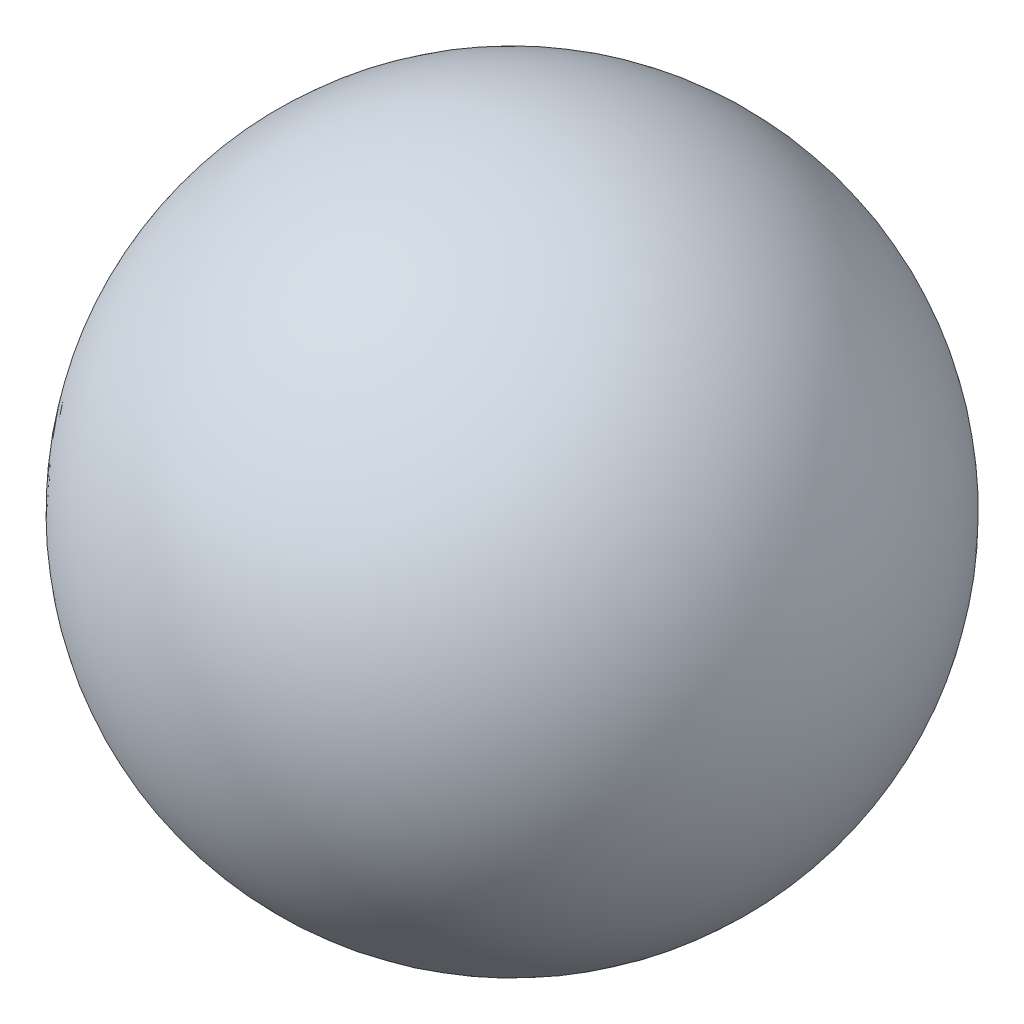
ISO-10303-21;
HEADER;
FILE_DESCRIPTION(('STEP AP214'),'2;1');
FILE_NAME('part.step','',(''),(''),'','','');
FILE_SCHEMA(('AUTOMOTIVE_DESIGN { 1 0 10303 214 1 1 1 1 }'));
ENDSEC;
DATA;
#1=APPLICATION_CONTEXT('core data for automotive mechanical design processes');
#2=APPLICATION_PROTOCOL_DEFINITION('international standard','automotive_design',2000,#1);
#3=PRODUCT_CONTEXT('',#1,'mechanical');
#4=PRODUCT('Part','Part','',(#3));
#5=PRODUCT_RELATED_PRODUCT_CATEGORY('part','',(#4));
#6=PRODUCT_DEFINITION_FORMATION('','',#4);
#7=PRODUCT_DEFINITION_CONTEXT('part definition',#1,'design');
#8=PRODUCT_DEFINITION('design','',#6,#7);
#9=PRODUCT_DEFINITION_SHAPE('','',#8);
#10=(LENGTH_UNIT() NAMED_UNIT(*) SI_UNIT(.MILLI.,.METRE.));
#11=(NAMED_UNIT(*) PLANE_ANGLE_UNIT() SI_UNIT($,.RADIAN.));
#12=(NAMED_UNIT(*) SI_UNIT($,.STERADIAN.) SOLID_ANGLE_UNIT());
#13=UNCERTAINTY_MEASURE_WITH_UNIT(LENGTH_MEASURE(1.E-05),#10,'distance_accuracy_value','');
#14=(GEOMETRIC_REPRESENTATION_CONTEXT(3) GLOBAL_UNCERTAINTY_ASSIGNED_CONTEXT((#13)) GLOBAL_UNIT_ASSIGNED_CONTEXT((#10,
#11,#12)) REPRESENTATION_CONTEXT('',''));
#15=CARTESIAN_POINT('',(0.,0.,0.));
#16=DIRECTION('',(0.,0.,1.));
#17=DIRECTION('',(1.,0.,0.));
#18=AXIS2_PLACEMENT_3D('',#15,#16,#17);
#19=CARTESIAN_POINT('',(0.,-2.36880771697491,2.36880771697496));
#20=DIRECTION('',(0.0518886958674214,0.768366870657261,0.637902747538797));
#21=DIRECTION('',(-0.861149178567501,-0.289030192759077,0.418190913251555));
#22=AXIS2_PLACEMENT_3D('',#19,#20,#21);
#23=SPHERICAL_SURFACE('',#22,0.794);
#24=CARTESIAN_POINT('',(0.0411996245187326,-1.75872442167305,2.87530249852076));
#25=VERTEX_POINT('',#24);
#26=VERTEX_LOOP('',#25);
#27=FACE_BOUND('',#26,.T.);
#28=CARTESIAN_POINT('',(-0.0411996245187327,-2.97889101227678,1.86231293542915));
#29=VERTEX_POINT('',#28);
#30=VERTEX_LOOP('',#29);
#31=FACE_BOUND('',#30,.T.);
#32=ADVANCED_FACE('F16',(#27,#31),#23,.T.);
#33=CLOSED_SHELL('',(#32));
#34=MANIFOLD_SOLID_BREP('B1',#33);
#35=ADVANCED_BREP_SHAPE_REPRESENTATION('',(#18,#34),#14);
#36=SHAPE_DEFINITION_REPRESENTATION(#9,#35);
ENDSEC;
END-ISO-10303-21;
